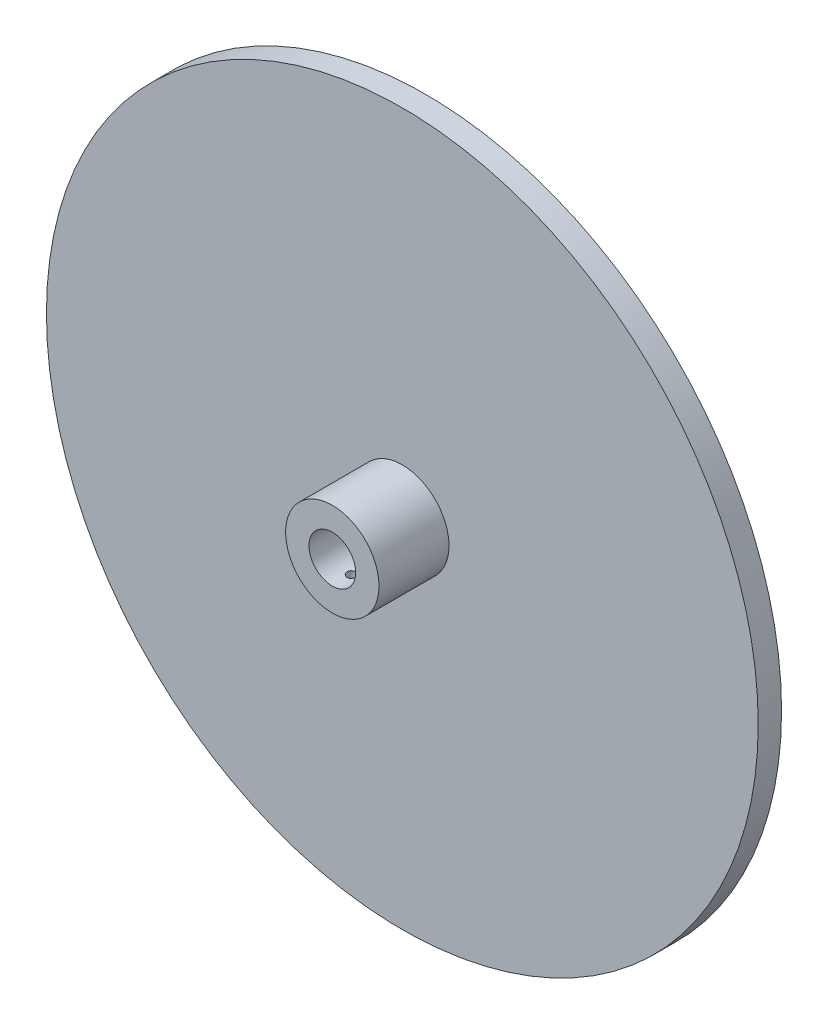
ISO-10303-21;
HEADER;
FILE_DESCRIPTION(('STEP AP214'),'2;1');
FILE_NAME('part.step','',(''),(''),'','','');
FILE_SCHEMA(('AUTOMOTIVE_DESIGN { 1 0 10303 214 1 1 1 1 }'));
ENDSEC;
DATA;
#1=APPLICATION_CONTEXT('core data for automotive mechanical design processes');
#2=APPLICATION_PROTOCOL_DEFINITION('international standard','automotive_design',2000,#1);
#3=PRODUCT_CONTEXT('',#1,'mechanical');
#4=PRODUCT('Part','Part','',(#3));
#5=PRODUCT_RELATED_PRODUCT_CATEGORY('part','',(#4));
#6=PRODUCT_DEFINITION_FORMATION('','',#4);
#7=PRODUCT_DEFINITION_CONTEXT('part definition',#1,'design');
#8=PRODUCT_DEFINITION('design','',#6,#7);
#9=PRODUCT_DEFINITION_SHAPE('','',#8);
#10=(LENGTH_UNIT() NAMED_UNIT(*) SI_UNIT(.MILLI.,.METRE.));
#11=(NAMED_UNIT(*) PLANE_ANGLE_UNIT() SI_UNIT($,.RADIAN.));
#12=(NAMED_UNIT(*) SI_UNIT($,.STERADIAN.) SOLID_ANGLE_UNIT());
#13=UNCERTAINTY_MEASURE_WITH_UNIT(LENGTH_MEASURE(1.E-05),#10,'distance_accuracy_value','');
#14=(GEOMETRIC_REPRESENTATION_CONTEXT(3) GLOBAL_UNCERTAINTY_ASSIGNED_CONTEXT((#13)) GLOBAL_UNIT_ASSIGNED_CONTEXT((#10,
#11,#12)) REPRESENTATION_CONTEXT('',''));
#15=CARTESIAN_POINT('',(0.,0.,0.));
#16=DIRECTION('',(0.,0.,1.));
#17=DIRECTION('',(1.,0.,0.));
#18=AXIS2_PLACEMENT_3D('',#15,#16,#17);
#19=CARTESIAN_POINT('',(0.,0.,10.));
#20=DIRECTION('',(0.,0.,1.));
#21=DIRECTION('',(1.,0.,0.));
#22=AXIS2_PLACEMENT_3D('',#19,#20,#21);
#23=PLANE('',#22);
#24=CARTESIAN_POINT('',(0.,0.,10.));
#25=DIRECTION('',(0.,0.,1.));
#26=DIRECTION('',(1.,0.,0.));
#27=AXIS2_PLACEMENT_3D('',#24,#25,#26);
#28=CIRCLE('',#27,152.5);
#29=CARTESIAN_POINT('',(152.5,0.,10.));
#30=VERTEX_POINT('',#29);
#31=EDGE_CURVE('E10',#30,#30,#28,.T.);
#32=ORIENTED_EDGE('',*,*,#31,.T.);
#33=EDGE_LOOP('',(#32));
#34=FACE_BOUND('',#33,.T.);
#35=CARTESIAN_POINT('',(0.,0.,10.));
#36=DIRECTION('',(0.,0.,1.));
#37=DIRECTION('',(1.,0.,0.));
#38=AXIS2_PLACEMENT_3D('',#35,#36,#37);
#39=CIRCLE('',#38,20.);
#40=CARTESIAN_POINT('',(20.,0.,10.));
#41=VERTEX_POINT('',#40);
#42=EDGE_CURVE('E53',#41,#41,#39,.T.);
#43=ORIENTED_EDGE('',*,*,#42,.F.);
#44=EDGE_LOOP('',(#43));
#45=FACE_BOUND('',#44,.T.);
#46=ADVANCED_FACE('F31',(#34,#45),#23,.T.);
#47=CARTESIAN_POINT('',(0.,0.,0.));
#48=DIRECTION('',(0.,0.,1.));
#49=DIRECTION('',(1.,0.,0.));
#50=AXIS2_PLACEMENT_3D('',#47,#48,#49);
#51=PLANE('',#50);
#52=CARTESIAN_POINT('',(0.,0.,0.));
#53=DIRECTION('',(0.,0.,1.));
#54=DIRECTION('',(1.,0.,0.));
#55=AXIS2_PLACEMENT_3D('',#52,#53,#54);
#56=CIRCLE('',#55,152.5);
#57=CARTESIAN_POINT('',(152.5,0.,0.));
#58=VERTEX_POINT('',#57);
#59=EDGE_CURVE('E43',#58,#58,#56,.T.);
#60=ORIENTED_EDGE('',*,*,#59,.F.);
#61=EDGE_LOOP('',(#60));
#62=FACE_BOUND('',#61,.T.);
#63=CARTESIAN_POINT('',(0.,0.,0.));
#64=DIRECTION('',(0.,0.,1.));
#65=DIRECTION('',(1.,0.,0.));
#66=AXIS2_PLACEMENT_3D('',#63,#64,#65);
#67=CIRCLE('',#66,10.);
#68=CARTESIAN_POINT('',(10.,0.,0.));
#69=VERTEX_POINT('',#68);
#70=EDGE_CURVE('E48',#69,#69,#67,.T.);
#71=ORIENTED_EDGE('',*,*,#70,.T.);
#72=EDGE_LOOP('',(#71));
#73=FACE_BOUND('',#72,.T.);
#74=ADVANCED_FACE('F87',(#62,#73),#51,.F.);
#75=CARTESIAN_POINT('',(0.,0.,10.));
#76=DIRECTION('',(0.,0.,-1.));
#77=DIRECTION('',(-1.,0.,0.));
#78=AXIS2_PLACEMENT_3D('',#75,#76,#77);
#79=CYLINDRICAL_SURFACE('',#78,152.5);
#80=ORIENTED_EDGE('',*,*,#31,.F.);
#81=EDGE_LOOP('',(#80));
#82=FACE_BOUND('',#81,.T.);
#83=ORIENTED_EDGE('',*,*,#59,.T.);
#84=EDGE_LOOP('',(#83));
#85=FACE_BOUND('',#84,.T.);
#86=ADVANCED_FACE('F33',(#82,#85),#79,.T.);
#87=CARTESIAN_POINT('',(0.,0.,10.));
#88=DIRECTION('',(0.,0.,-1.));
#89=DIRECTION('',(-1.,0.,0.));
#90=AXIS2_PLACEMENT_3D('',#87,#88,#89);
#91=CYLINDRICAL_SURFACE('',#90,10.);
#92=CARTESIAN_POINT('',(0.,-10.,33.6386187237673));
#93=CARTESIAN_POINT('',(0.111153813585266,-9.99999795161742,33.6386146347706));
#94=CARTESIAN_POINT('',(0.222359320403044,-9.99812770356462,33.629321037832));
#95=CARTESIAN_POINT('',(0.441627015378038,-9.99084731246463,33.5924217235368));
#96=CARTESIAN_POINT('',(0.549686635082711,-9.98543435720372,33.5648014581643));
#97=CARTESIAN_POINT('',(0.759460610526626,-9.97167298556574,33.4921361765257));
#98=CARTESIAN_POINT('',(0.861180935866269,-9.96332738153436,33.4471078500779));
#99=CARTESIAN_POINT('',(1.05561597772845,-9.94460796070629,33.3409542287447));
#100=CARTESIAN_POINT('',(1.14833123015162,-9.93423426471414,33.2798298925529));
#101=CARTESIAN_POINT('',(1.32338695462973,-9.9124433065994,33.1423417351844));
#102=CARTESIAN_POINT('',(1.40558790231705,-9.90101491008695,33.0658020129849));
#103=CARTESIAN_POINT('',(1.55607351321606,-9.87848360905177,32.9000338909839));
#104=CARTESIAN_POINT('',(1.62435708954085,-9.86738073000848,32.8108045010971));
#105=CARTESIAN_POINT('',(1.74566350669524,-9.84664883625231,32.6211863377436));
#106=CARTESIAN_POINT('',(1.79854187773173,-9.83703414729892,32.5207034361746));
#107=CARTESIAN_POINT('',(1.88661133316062,-9.82052536116836,32.3120550857592));
#108=CARTESIAN_POINT('',(1.92180416487448,-9.81363099523924,32.2038903970746));
#109=CARTESIAN_POINT('',(1.97305059976966,-9.80345610504409,31.9844499959515));
#110=CARTESIAN_POINT('',(1.98934899591755,-9.80012940214375,31.8732336354829));
#111=CARTESIAN_POINT('',(2.00310425545224,-9.79732750121255,31.6495990810386));
#112=CARTESIAN_POINT('',(2.000563045427,-9.79785190935682,31.537181011127));
#113=CARTESIAN_POINT('',(1.97690914620364,-9.80265102296369,31.3161251477253));
#114=CARTESIAN_POINT('',(1.95607708048781,-9.80686905717527,31.2074559125127));
#115=CARTESIAN_POINT('',(1.8968757692461,-9.81849092320002,30.9951865704413));
#116=CARTESIAN_POINT('',(1.85850568620136,-9.82589490715558,30.8915867059293));
#117=CARTESIAN_POINT('',(1.76504956734944,-9.84311237000816,30.6915882003601));
#118=CARTESIAN_POINT('',(1.70985230246423,-9.85294179627409,30.595242964629));
#119=CARTESIAN_POINT('',(1.58438714914536,-9.87389237546124,30.4130770238217));
#120=CARTESIAN_POINT('',(1.51411752871366,-9.88501367676732,30.327257530065));
#121=CARTESIAN_POINT('',(1.35899986912117,-9.90754042482924,30.1669599188534));
#122=CARTESIAN_POINT('',(1.27391232242489,-9.9189473842181,30.0927135880491));
#123=CARTESIAN_POINT('',(1.09237004812402,-9.94057697428817,29.9595110311649));
#124=CARTESIAN_POINT('',(0.995915174758779,-9.95079958977947,29.9005550011802));
#125=CARTESIAN_POINT('',(0.794118773757842,-9.96893380321774,29.7995637053154));
#126=CARTESIAN_POINT('',(0.688763639170601,-9.97684177696544,29.7575549364782));
#127=CARTESIAN_POINT('',(0.47229795289733,-9.98942817975717,29.6918977756902));
#128=CARTESIAN_POINT('',(0.3611881001449,-9.99410700001063,29.6682471596201));
#129=CARTESIAN_POINT('',(0.138358811254302,-9.99965343733736,29.6403058161788));
#130=CARTESIAN_POINT('',(0.0266806566511533,-10.0005834930494,29.6356978846868));
#131=CARTESIAN_POINT('',(-0.195849868385428,-9.99870103860205,29.6451184416517));
#132=CARTESIAN_POINT('',(-0.306702284887586,-9.99588873882892,29.6591458824725));
#133=CARTESIAN_POINT('',(-0.523411319893082,-9.98687664016035,29.7051754708552));
#134=CARTESIAN_POINT('',(-0.629303896679806,-9.98070752808413,29.7370148607631));
#135=CARTESIAN_POINT('',(-0.834247254999334,-9.96567104122066,29.8175866890789));
#136=CARTESIAN_POINT('',(-0.933297523275079,-9.95680346428454,29.866320393121));
#137=CARTESIAN_POINT('',(-1.12308234737244,-9.93719823066589,29.9799837050699));
#138=CARTESIAN_POINT('',(-1.21370025350438,-9.92643900874104,30.0451042858452));
#139=CARTESIAN_POINT('',(-1.38283603823841,-9.90429469659765,30.1894371061819));
#140=CARTESIAN_POINT('',(-1.46135261786152,-9.89290953936776,30.268650856567));
#141=CARTESIAN_POINT('',(-1.60528118154835,-9.8705860711393,30.4403654275496));
#142=CARTESIAN_POINT('',(-1.67047540489731,-9.85965720466609,30.53305021221));
#143=CARTESIAN_POINT('',(-1.78437084010241,-9.83968383592389,30.7282414464807));
#144=CARTESIAN_POINT('',(-1.83307271184581,-9.83063925826685,30.8307475029144));
#145=CARTESIAN_POINT('',(-1.91230368316392,-9.81553481168766,31.0421552160664));
#146=CARTESIAN_POINT('',(-1.9429269995821,-9.80945949744373,31.151020406188));
#147=CARTESIAN_POINT('',(-1.98541730325439,-9.80094873584051,31.3724856307491));
#148=CARTESIAN_POINT('',(-1.99728673645023,-9.79851281382223,31.485085176186));
#149=CARTESIAN_POINT('',(-2.00184182173494,-9.79758299262759,31.708636452856));
#150=CARTESIAN_POINT('',(-1.99487157614179,-9.79901838378602,31.8195810216213));
#151=CARTESIAN_POINT('',(-1.96270460820012,-9.80551146969228,32.0386820235774));
#152=CARTESIAN_POINT('',(-1.9375080322586,-9.81056913534338,32.1468384791569));
#153=CARTESIAN_POINT('',(-1.86975713699791,-9.82370528438317,32.3570741462484));
#154=CARTESIAN_POINT('',(-1.82724501343469,-9.83177642037661,32.4591674447722));
#155=CARTESIAN_POINT('',(-1.72610928920321,-9.85003429948341,32.6548261652362));
#156=CARTESIAN_POINT('',(-1.66748433754977,-9.86022121997788,32.7483908712176));
#157=CARTESIAN_POINT('',(-1.53461182957283,-9.88177921046451,32.9260498680679));
#158=CARTESIAN_POINT('',(-1.46011577447036,-9.89316745819399,33.0099562543025));
#159=CARTESIAN_POINT('',(-1.29812873802628,-9.9157216374391,33.1641911348257));
#160=CARTESIAN_POINT('',(-1.21063477430667,-9.92688751726369,33.2345165044019));
#161=CARTESIAN_POINT('',(-1.02403525817649,-9.94787664775943,33.3602880116602));
#162=CARTESIAN_POINT('',(-0.924817768859664,-9.95768462438492,33.4155707303274));
#163=CARTESIAN_POINT('',(-0.718332721881459,-9.9747025017,33.5085909689605));
#164=CARTESIAN_POINT('',(-0.611072521726248,-9.98191474277232,33.5463443028323));
#165=CARTESIAN_POINT('',(-0.419642977847556,-9.99152745190741,33.5959226198568));
#166=CARTESIAN_POINT('',(-0.336563328027566,-9.99468606316904,33.6119051111828));
#167=CARTESIAN_POINT('',(-0.168999050420132,-9.99892308279786,33.633254548484));
#168=CARTESIAN_POINT('',(-0.0845144674972372,-10.0000015574631,33.6386218327869));
#169=CARTESIAN_POINT('',(0.,-10.,33.6386187237673));
#170=B_SPLINE_CURVE_WITH_KNOTS('',3,(#92,#93,#94,#95,#96,#97,#98,#99,#100,#101,#102,#103,#104,
#105,#106,#107,#108,#109,#110,#111,#112,#113,#114,#115,#116,#117,#118,#119,#120,#121,#122,#123,
#124,#125,#126,#127,#128,#129,#130,#131,#132,#133,#134,#135,#136,#137,#138,#139,#140,#141,#142,
#143,#144,#145,#146,#147,#148,#149,#150,#151,#152,#153,#154,#155,#156,#157,#158,#159,#160,#161,
#162,#163,#164,#165,#166,#167,#168,#169),.UNSPECIFIED.,.T.,.F.,(4,2,2,2,2,2,2,2,2,2,2,2,2,2,2,2,
2,2,2,2,2,2,2,2,2,2,2,2,2,2,2,2,2,2,2,2,2,2,4),(0.,0.333152261322517,0.666569301382645,
0.999667470500684,1.33274580446173,1.66986534022438,2.00701119349473,2.34722390011845,
2.68740298730395,3.02312370207175,3.35881008562451,3.68943454012557,4.02007478507459,
4.35294980407185,4.68586309499341,5.02476504982701,5.3636713507964,5.70310549708048,
6.04249851396072,6.3762147135253,6.70991215315735,7.04060907901447,7.37133078432045,
7.70610132066717,8.0409077669186,8.38081257158452,8.72070377446933,9.05880762065447,
9.39686736660829,9.72879445135403,10.0607188698522,10.3918392250622,10.7229873516373,
11.0597615247829,11.3966130906586,11.7369899335127,12.0770591103504,12.3303755057979,
12.5836838274199),.UNSPECIFIED.);
#171=CARTESIAN_POINT('',(0.,-10.,33.6386187237673));
#172=VERTEX_POINT('',#171);
#173=EDGE_CURVE('E61',#172,#172,#170,.T.);
#174=ORIENTED_EDGE('',*,*,#173,.F.);
#175=EDGE_LOOP('',(#174));
#176=FACE_BOUND('',#175,.T.);
#177=ORIENTED_EDGE('',*,*,#70,.F.);
#178=EDGE_LOOP('',(#177));
#179=FACE_BOUND('',#178,.T.);
#180=CARTESIAN_POINT('',(0.,0.,40.));
#181=DIRECTION('',(0.,0.,1.));
#182=DIRECTION('',(1.,0.,0.));
#183=AXIS2_PLACEMENT_3D('',#180,#181,#182);
#184=CIRCLE('',#183,10.);
#185=CARTESIAN_POINT('',(10.,0.,40.));
#186=VERTEX_POINT('',#185);
#187=EDGE_CURVE('E56',#186,#186,#184,.T.);
#188=ORIENTED_EDGE('',*,*,#187,.T.);
#189=EDGE_LOOP('',(#188));
#190=FACE_BOUND('',#189,.T.);
#191=ADVANCED_FACE('F66',(#176,#179,#190),#91,.F.);
#192=CARTESIAN_POINT('',(0.,0.,40.));
#193=DIRECTION('',(0.,0.,1.));
#194=DIRECTION('',(1.,0.,0.));
#195=AXIS2_PLACEMENT_3D('',#192,#193,#194);
#196=PLANE('',#195);
#197=CARTESIAN_POINT('',(0.,0.,40.));
#198=DIRECTION('',(0.,0.,1.));
#199=DIRECTION('',(1.,0.,0.));
#200=AXIS2_PLACEMENT_3D('',#197,#198,#199);
#201=CIRCLE('',#200,20.);
#202=CARTESIAN_POINT('',(20.,0.,40.));
#203=VERTEX_POINT('',#202);
#204=EDGE_CURVE('E52',#203,#203,#201,.T.);
#205=ORIENTED_EDGE('',*,*,#204,.T.);
#206=EDGE_LOOP('',(#205));
#207=FACE_BOUND('',#206,.T.);
#208=ORIENTED_EDGE('',*,*,#187,.F.);
#209=EDGE_LOOP('',(#208));
#210=FACE_BOUND('',#209,.T.);
#211=ADVANCED_FACE('F75',(#207,#210),#196,.T.);
#212=CARTESIAN_POINT('',(0.,0.,40.));
#213=DIRECTION('',(0.,0.,-1.));
#214=DIRECTION('',(-1.,0.,0.));
#215=AXIS2_PLACEMENT_3D('',#212,#213,#214);
#216=CYLINDRICAL_SURFACE('',#215,20.);
#217=CARTESIAN_POINT('',(0.,-20.,33.6386187237673));
#218=CARTESIAN_POINT('',(0.112040707583114,-19.9999987104154,33.6386138719666));
#219=CARTESIAN_POINT('',(0.224155490335546,-19.9990485119241,33.6291721859744));
#220=CARTESIAN_POINT('',(0.445276796993674,-19.9953493518948,33.5916499831865));
#221=CARTESIAN_POINT('',(0.554279758337656,-19.9925984086805,33.5635489317181));
#222=CARTESIAN_POINT('',(0.76594335090683,-19.9856082912614,33.4895342425717));
#223=CARTESIAN_POINT('',(0.86860776922982,-19.9813700160142,33.4436313627304));
#224=CARTESIAN_POINT('',(1.06475232192081,-19.9718791478861,33.335336907904));
#225=CARTESIAN_POINT('',(1.15823427755815,-19.9666267567626,33.272948611767));
#226=CARTESIAN_POINT('',(1.33371910134816,-19.9556748868265,33.1332133284428));
#227=CARTESIAN_POINT('',(1.41568428966979,-19.9499740314773,33.0558191249633));
#228=CARTESIAN_POINT('',(1.56548504286197,-19.9387791381252,32.8883696552413));
#229=CARTESIAN_POINT('',(1.63331995416531,-19.9332851096983,32.7983138036825));
#230=CARTESIAN_POINT('',(1.75306794088723,-19.9231118310557,32.6078616604001));
#231=CARTESIAN_POINT('',(1.80494693090976,-19.9184343342181,32.5074438355776));
#232=CARTESIAN_POINT('',(1.89109276948552,-19.9104407509305,32.2992675519574));
#233=CARTESIAN_POINT('',(1.92536005318258,-19.9071246308444,32.1915092745994));
#234=CARTESIAN_POINT('',(1.97519808320379,-19.9022416814596,31.9720951220353));
#235=CARTESIAN_POINT('',(1.99083130600759,-19.9006690079619,31.8604535700629));
#236=CARTESIAN_POINT('',(2.00315057027072,-19.8994328612105,31.6361209969758));
#237=CARTESIAN_POINT('',(1.9998371097416,-19.8997693377749,31.5234300035232));
#238=CARTESIAN_POINT('',(1.97440856050536,-19.9023081379787,31.3006281043807));
#239=CARTESIAN_POINT('',(1.9523616882491,-19.904503691813,31.1905093251099));
#240=CARTESIAN_POINT('',(1.89019828830117,-19.9105026857484,30.9755427973651));
#241=CARTESIAN_POINT('',(1.85008151651149,-19.9143061475698,30.8706951201173));
#242=CARTESIAN_POINT('',(1.75284178776301,-19.9231001890414,30.6690315491695));
#243=CARTESIAN_POINT('',(1.69568856543996,-19.9280928781631,30.5722303447887));
#244=CARTESIAN_POINT('',(1.56602005470645,-19.9387010346576,30.3895682939436));
#245=CARTESIAN_POINT('',(1.49350431667301,-19.9443165202557,30.3037077678038));
#246=CARTESIAN_POINT('',(1.33478822482414,-19.9555677062598,30.1449679357893));
#247=CARTESIAN_POINT('',(1.24852895770273,-19.9612033866599,30.0721475200057));
#248=CARTESIAN_POINT('',(1.06497896347422,-19.9718365815704,29.9420114579465));
#249=CARTESIAN_POINT('',(0.9676882239992,-19.9768340953651,29.8846958290544));
#250=CARTESIAN_POINT('',(0.764796211384728,-19.9856295133419,29.7871986831468));
#251=CARTESIAN_POINT('',(0.659193492779806,-19.9894272082954,29.7470201541312));
#252=CARTESIAN_POINT('',(0.442694434659864,-19.9953929488282,29.6849808903438));
#253=CARTESIAN_POINT('',(0.331798253553201,-19.9975610431413,29.6631196077861));
#254=CARTESIAN_POINT('',(0.108370198183808,-20.0000170333662,29.6384101082978));
#255=CARTESIAN_POINT('',(-0.00415260421098323,-20.0003129653547,29.6354806272623));
#256=CARTESIAN_POINT('',(-0.228087586631399,-19.9990128351359,29.6485044498648));
#257=CARTESIAN_POINT('',(-0.33949978164094,-19.9974167984894,29.6644574983979));
#258=CARTESIAN_POINT('',(-0.557816413669349,-19.9925172307839,29.7147261146105));
#259=CARTESIAN_POINT('',(-0.664729697944039,-19.9892172383608,29.7490036327233));
#260=CARTESIAN_POINT('',(-0.871288642767563,-19.9812799772122,29.8349090718419));
#261=CARTESIAN_POINT('',(-0.970934140314235,-19.9766426785051,29.8865373818461));
#262=CARTESIAN_POINT('',(-1.16049636034428,-19.9665295066084,30.0058804010951));
#263=CARTESIAN_POINT('',(-1.25037931949783,-19.9610508720688,30.073648501619));
#264=CARTESIAN_POINT('',(-1.41752324662376,-19.9498786573904,30.2232708592492));
#265=CARTESIAN_POINT('',(-1.49478389769835,-19.9441850718594,30.305125469908));
#266=CARTESIAN_POINT('',(-1.63477221977429,-19.9332004828151,30.4809518730853));
#267=CARTESIAN_POINT('',(-1.69744655735909,-19.9279110027795,30.5749662368526));
#268=CARTESIAN_POINT('',(-1.80611651748765,-19.9183566492178,30.7722334440607));
#269=CARTESIAN_POINT('',(-1.85211236810776,-19.9140917616808,30.8754861611441));
#270=CARTESIAN_POINT('',(-1.92603041736895,-19.907078952681,31.0881162026989));
#271=CARTESIAN_POINT('',(-1.95398434962372,-19.9043283689958,31.1974824039496));
#272=CARTESIAN_POINT('',(-1.99112801425892,-19.9006473056575,31.4193851196889));
#273=CARTESIAN_POINT('',(-2.00031828479903,-19.8997167738037,31.5319215431587));
#274=CARTESIAN_POINT('',(-1.99966627694251,-19.8997822621512,31.7564401004807));
#275=CARTESIAN_POINT('',(-1.98990777918622,-19.9007698017402,31.8684224895329));
#276=CARTESIAN_POINT('',(-1.95181090592731,-19.9045420777909,32.0891485581039));
#277=CARTESIAN_POINT('',(-1.92347250952432,-19.9073268162744,32.1978922339793));
#278=CARTESIAN_POINT('',(-1.849043372595,-19.9143773652637,32.409053421863));
#279=CARTESIAN_POINT('',(-1.80295508868183,-19.9186429708072,32.5114718070268));
#280=CARTESIAN_POINT('',(-1.69434310982209,-19.9281750367872,32.7071325071094));
#281=CARTESIAN_POINT('',(-1.63181950691083,-19.933441491619,32.8003748734086));
#282=CARTESIAN_POINT('',(-1.49179711257067,-19.944409744194,32.9754660727112));
#283=CARTESIAN_POINT('',(-1.41423589778054,-19.950113294535,33.0572648765015));
#284=CARTESIAN_POINT('',(-1.24646339845022,-19.9612970945757,33.2067231891666));
#285=CARTESIAN_POINT('',(-1.15624908821652,-19.9667772904595,33.2743793064817));
#286=CARTESIAN_POINT('',(-0.965482868322584,-19.9769112413832,33.3937656314766));
#287=CARTESIAN_POINT('',(-0.864905498693532,-19.9815628805362,33.4454553056577));
#288=CARTESIAN_POINT('',(-0.656516558201106,-19.9894925849979,33.5311435694151));
#289=CARTESIAN_POINT('',(-0.548713299651223,-19.9927721981931,33.5651621056744));
#290=CARTESIAN_POINT('',(-0.366916522811412,-19.9967642754747,33.6060599579369));
#291=CARTESIAN_POINT('',(-0.29408510568902,-19.9979720138367,33.618252812366));
#292=CARTESIAN_POINT('',(-0.147513161634627,-19.9995902990157,33.6345337758908));
#293=CARTESIAN_POINT('',(-0.0737726384531163,-20.0000008491205,33.638621918411));
#294=CARTESIAN_POINT('',(0.,-20.,33.6386187237673));
#295=B_SPLINE_CURVE_WITH_KNOTS('',3,(#217,#218,#219,#220,#221,#222,#223,#224,#225,#226,#227,
#228,#229,#230,#231,#232,#233,#234,#235,#236,#237,#238,#239,#240,#241,#242,#243,#244,#245,#246,
#247,#248,#249,#250,#251,#252,#253,#254,#255,#256,#257,#258,#259,#260,#261,#262,#263,#264,#265,
#266,#267,#268,#269,#270,#271,#272,#273,#274,#275,#276,#277,#278,#279,#280,#281,#282,#283,#284,
#285,#286,#287,#288,#289,#290,#291,#292,#293,#294),.UNSPECIFIED.,.T.,.F.,(4,2,2,2,2,2,2,2,2,2,2,
2,2,2,2,2,2,2,2,2,2,2,2,2,2,2,2,2,2,2,2,2,2,2,2,2,2,2,4),(0.,0.335852732536947,
0.672075685670972,1.00809577146441,1.34404907516557,1.68107713724589,2.01812078441412,
2.35587950944443,2.69362988885008,3.03024464090394,3.36685054511553,3.70223594882221,
4.03762588323267,4.37361522745789,4.70961440662251,5.04709468392413,5.38457533959544,
5.72211481387163,6.05964419350879,6.39572377215515,6.73179881038287,7.0671787058861,
7.40256612098934,7.73907881497397,8.0755999562046,8.41333287217197,8.75106116950748,
9.08819381186006,9.4253167847917,9.76095258587913,10.0965887645208,10.432178507256,
10.7677663707792,11.1047783485531,11.4418710527391,11.7798126205248,12.1173718959059,
12.338513344647,12.5596538813805),.UNSPECIFIED.);
#296=CARTESIAN_POINT('',(0.,-20.,33.6386187237673));
#297=VERTEX_POINT('',#296);
#298=EDGE_CURVE('E35',#297,#297,#295,.T.);
#299=ORIENTED_EDGE('',*,*,#298,.T.);
#300=EDGE_LOOP('',(#299));
#301=FACE_BOUND('',#300,.T.);
#302=ORIENTED_EDGE('',*,*,#204,.F.);
#303=EDGE_LOOP('',(#302));
#304=FACE_BOUND('',#303,.T.);
#305=ORIENTED_EDGE('',*,*,#42,.T.);
#306=EDGE_LOOP('',(#305));
#307=FACE_BOUND('',#306,.T.);
#308=ADVANCED_FACE('F73',(#301,#304,#307),#216,.T.);
#309=CARTESIAN_POINT('',(0.,-60.,31.6386187237673));
#310=DIRECTION('',(0.,1.,0.));
#311=DIRECTION('',(0.,0.,1.));
#312=AXIS2_PLACEMENT_3D('',#309,#310,#311);
#313=CYLINDRICAL_SURFACE('',#312,2.);
#314=ORIENTED_EDGE('',*,*,#173,.T.);
#315=EDGE_LOOP('',(#314));
#316=FACE_BOUND('',#315,.T.);
#317=ORIENTED_EDGE('',*,*,#298,.F.);
#318=EDGE_LOOP('',(#317));
#319=FACE_BOUND('',#318,.T.);
#320=ADVANCED_FACE('F69',(#316,#319),#313,.F.);
#321=CLOSED_SHELL('',(#46,#74,#86,#191,#211,#308,#320));
#322=MANIFOLD_SOLID_BREP('B2',#321);
#323=ADVANCED_BREP_SHAPE_REPRESENTATION('',(#18,#322),#14);
#324=SHAPE_DEFINITION_REPRESENTATION(#9,#323);
ENDSEC;
END-ISO-10303-21;
